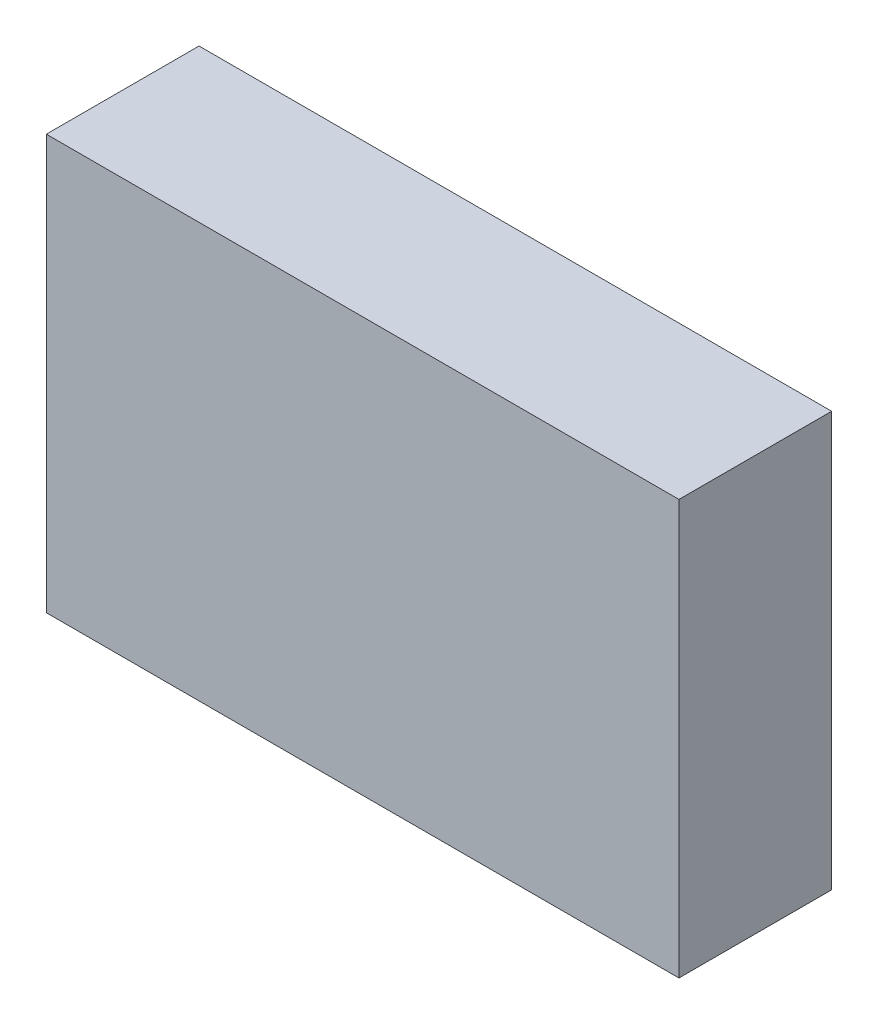
ISO-10303-21;
HEADER;
FILE_DESCRIPTION(('STEP AP214'),'2;1');
FILE_NAME('part.step','',(''),(''),'','','');
FILE_SCHEMA(('AUTOMOTIVE_DESIGN { 1 0 10303 214 1 1 1 1 }'));
ENDSEC;
DATA;
#1=APPLICATION_CONTEXT('core data for automotive mechanical design processes');
#2=APPLICATION_PROTOCOL_DEFINITION('international standard','automotive_design',2000,#1);
#3=PRODUCT_CONTEXT('',#1,'mechanical');
#4=PRODUCT('Part','Part','',(#3));
#5=PRODUCT_RELATED_PRODUCT_CATEGORY('part','',(#4));
#6=PRODUCT_DEFINITION_FORMATION('','',#4);
#7=PRODUCT_DEFINITION_CONTEXT('part definition',#1,'design');
#8=PRODUCT_DEFINITION('design','',#6,#7);
#9=PRODUCT_DEFINITION_SHAPE('','',#8);
#10=(LENGTH_UNIT() NAMED_UNIT(*) SI_UNIT(.MILLI.,.METRE.));
#11=(NAMED_UNIT(*) PLANE_ANGLE_UNIT() SI_UNIT($,.RADIAN.));
#12=(NAMED_UNIT(*) SI_UNIT($,.STERADIAN.) SOLID_ANGLE_UNIT());
#13=UNCERTAINTY_MEASURE_WITH_UNIT(LENGTH_MEASURE(1.E-05),#10,'distance_accuracy_value','');
#14=(GEOMETRIC_REPRESENTATION_CONTEXT(3) GLOBAL_UNCERTAINTY_ASSIGNED_CONTEXT((#13)) GLOBAL_UNIT_ASSIGNED_CONTEXT((#10,
#11,#12)) REPRESENTATION_CONTEXT('',''));
#15=CARTESIAN_POINT('',(0.,0.,0.));
#16=DIRECTION('',(0.,0.,1.));
#17=DIRECTION('',(1.,0.,0.));
#18=AXIS2_PLACEMENT_3D('',#15,#16,#17);
#19=CARTESIAN_POINT('',(0.,0.,70.));
#20=DIRECTION('',(1.,0.,0.));
#21=DIRECTION('',(0.,0.,-1.));
#22=AXIS2_PLACEMENT_3D('',#19,#20,#21);
#23=PLANE('',#22);
#24=DIRECTION('',(0.,-1.,0.));
#25=VECTOR('',#24,1.);
#26=CARTESIAN_POINT('',(0.,0.,0.));
#27=LINE('',#26,#25);
#28=CARTESIAN_POINT('',(0.,190.,0.));
#29=VERTEX_POINT('',#28);
#30=CARTESIAN_POINT('',(0.,0.,0.));
#31=VERTEX_POINT('',#30);
#32=EDGE_CURVE('E102',#29,#31,#27,.T.);
#33=ORIENTED_EDGE('',*,*,#32,.T.);
#34=DIRECTION('',(0.,0.,-1.));
#35=VECTOR('',#34,1.);
#36=CARTESIAN_POINT('',(0.,0.,70.));
#37=LINE('',#36,#35);
#38=CARTESIAN_POINT('',(0.,0.,70.));
#39=VERTEX_POINT('',#38);
#40=EDGE_CURVE('E11',#39,#31,#37,.T.);
#41=ORIENTED_EDGE('',*,*,#40,.F.);
#42=DIRECTION('',(0.,-1.,0.));
#43=VECTOR('',#42,1.);
#44=CARTESIAN_POINT('',(0.,0.,70.));
#45=LINE('',#44,#43);
#46=CARTESIAN_POINT('',(0.,190.,70.));
#47=VERTEX_POINT('',#46);
#48=EDGE_CURVE('E90',#47,#39,#45,.T.);
#49=ORIENTED_EDGE('',*,*,#48,.F.);
#50=DIRECTION('',(0.,0.,-1.));
#51=VECTOR('',#50,1.);
#52=CARTESIAN_POINT('',(0.,190.,70.));
#53=LINE('',#52,#51);
#54=EDGE_CURVE('E98',#47,#29,#53,.T.);
#55=ORIENTED_EDGE('',*,*,#54,.T.);
#56=EDGE_LOOP('',(#33,#41,#49,#55));
#57=FACE_BOUND('',#56,.T.);
#58=ADVANCED_FACE('F39',(#57),#23,.F.);
#59=CARTESIAN_POINT('',(0.,0.,70.));
#60=DIRECTION('',(0.,1.,0.));
#61=DIRECTION('',(0.,0.,1.));
#62=AXIS2_PLACEMENT_3D('',#59,#60,#61);
#63=PLANE('',#62);
#64=DIRECTION('',(1.,0.,0.));
#65=VECTOR('',#64,1.);
#66=CARTESIAN_POINT('',(0.,0.,0.));
#67=LINE('',#66,#65);
#68=CARTESIAN_POINT('',(290.,0.,0.));
#69=VERTEX_POINT('',#68);
#70=EDGE_CURVE('E94',#31,#69,#67,.T.);
#71=ORIENTED_EDGE('',*,*,#70,.T.);
#72=DIRECTION('',(0.,0.,-1.));
#73=VECTOR('',#72,1.);
#74=CARTESIAN_POINT('',(290.,0.,70.));
#75=LINE('',#74,#73);
#76=CARTESIAN_POINT('',(290.,0.,70.));
#77=VERTEX_POINT('',#76);
#78=EDGE_CURVE('E47',#77,#69,#75,.T.);
#79=ORIENTED_EDGE('',*,*,#78,.F.);
#80=DIRECTION('',(1.,0.,0.));
#81=VECTOR('',#80,1.);
#82=CARTESIAN_POINT('',(0.,0.,70.));
#83=LINE('',#82,#81);
#84=EDGE_CURVE('E85',#39,#77,#83,.T.);
#85=ORIENTED_EDGE('',*,*,#84,.F.);
#86=ORIENTED_EDGE('',*,*,#40,.T.);
#87=EDGE_LOOP('',(#71,#79,#85,#86));
#88=FACE_BOUND('',#87,.T.);
#89=ADVANCED_FACE('F93',(#88),#63,.F.);
#90=CARTESIAN_POINT('',(290.,0.,70.));
#91=DIRECTION('',(-1.,0.,0.));
#92=DIRECTION('',(0.,0.,1.));
#93=AXIS2_PLACEMENT_3D('',#90,#91,#92);
#94=PLANE('',#93);
#95=DIRECTION('',(0.,1.,0.));
#96=VECTOR('',#95,1.);
#97=CARTESIAN_POINT('',(290.,0.,0.));
#98=LINE('',#97,#96);
#99=CARTESIAN_POINT('',(290.,190.,0.));
#100=VERTEX_POINT('',#99);
#101=EDGE_CURVE('E72',#69,#100,#98,.T.);
#102=ORIENTED_EDGE('',*,*,#101,.T.);
#103=DIRECTION('',(0.,0.,-1.));
#104=VECTOR('',#103,1.);
#105=CARTESIAN_POINT('',(290.,190.,70.));
#106=LINE('',#105,#104);
#107=CARTESIAN_POINT('',(290.,190.,70.));
#108=VERTEX_POINT('',#107);
#109=EDGE_CURVE('E95',#108,#100,#106,.T.);
#110=ORIENTED_EDGE('',*,*,#109,.F.);
#111=DIRECTION('',(0.,1.,0.));
#112=VECTOR('',#111,1.);
#113=CARTESIAN_POINT('',(290.,0.,70.));
#114=LINE('',#113,#112);
#115=EDGE_CURVE('E88',#77,#108,#114,.T.);
#116=ORIENTED_EDGE('',*,*,#115,.F.);
#117=ORIENTED_EDGE('',*,*,#78,.T.);
#118=EDGE_LOOP('',(#102,#110,#116,#117));
#119=FACE_BOUND('',#118,.T.);
#120=ADVANCED_FACE('F96',(#119),#94,.F.);
#121=CARTESIAN_POINT('',(0.,190.,70.));
#122=DIRECTION('',(0.,-1.,0.));
#123=DIRECTION('',(0.,0.,-1.));
#124=AXIS2_PLACEMENT_3D('',#121,#122,#123);
#125=PLANE('',#124);
#126=DIRECTION('',(-1.,0.,0.));
#127=VECTOR('',#126,1.);
#128=CARTESIAN_POINT('',(0.,190.,0.));
#129=LINE('',#128,#127);
#130=EDGE_CURVE('E78',#100,#29,#129,.T.);
#131=ORIENTED_EDGE('',*,*,#130,.T.);
#132=ORIENTED_EDGE('',*,*,#54,.F.);
#133=DIRECTION('',(-1.,0.,0.));
#134=VECTOR('',#133,1.);
#135=CARTESIAN_POINT('',(0.,190.,70.));
#136=LINE('',#135,#134);
#137=EDGE_CURVE('E55',#108,#47,#136,.T.);
#138=ORIENTED_EDGE('',*,*,#137,.F.);
#139=ORIENTED_EDGE('',*,*,#109,.T.);
#140=EDGE_LOOP('',(#131,#132,#138,#139));
#141=FACE_BOUND('',#140,.T.);
#142=ADVANCED_FACE('F109',(#141),#125,.F.);
#143=CARTESIAN_POINT('',(0.,0.,70.));
#144=DIRECTION('',(0.,0.,-1.));
#145=DIRECTION('',(-1.,0.,0.));
#146=AXIS2_PLACEMENT_3D('',#143,#144,#145);
#147=PLANE('',#146);
#148=ORIENTED_EDGE('',*,*,#48,.T.);
#149=ORIENTED_EDGE('',*,*,#84,.T.);
#150=ORIENTED_EDGE('',*,*,#115,.T.);
#151=ORIENTED_EDGE('',*,*,#137,.T.);
#152=EDGE_LOOP('',(#148,#149,#150,#151));
#153=FACE_BOUND('',#152,.T.);
#154=ADVANCED_FACE('F86',(#153),#147,.F.);
#155=CARTESIAN_POINT('',(0.,0.,0.));
#156=DIRECTION('',(0.,0.,-1.));
#157=DIRECTION('',(-1.,0.,0.));
#158=AXIS2_PLACEMENT_3D('',#155,#156,#157);
#159=PLANE('',#158);
#160=ORIENTED_EDGE('',*,*,#32,.F.);
#161=ORIENTED_EDGE('',*,*,#130,.F.);
#162=ORIENTED_EDGE('',*,*,#101,.F.);
#163=ORIENTED_EDGE('',*,*,#70,.F.);
#164=EDGE_LOOP('',(#160,#161,#162,#163));
#165=FACE_BOUND('',#164,.T.);
#166=ADVANCED_FACE('F112',(#165),#159,.T.);
#167=CLOSED_SHELL('',(#58,#89,#120,#142,#154,#166));
#168=MANIFOLD_SOLID_BREP('B2',#167);
#169=ADVANCED_BREP_SHAPE_REPRESENTATION('',(#18,#168),#14);
#170=SHAPE_DEFINITION_REPRESENTATION(#9,#169);
ENDSEC;
END-ISO-10303-21;
